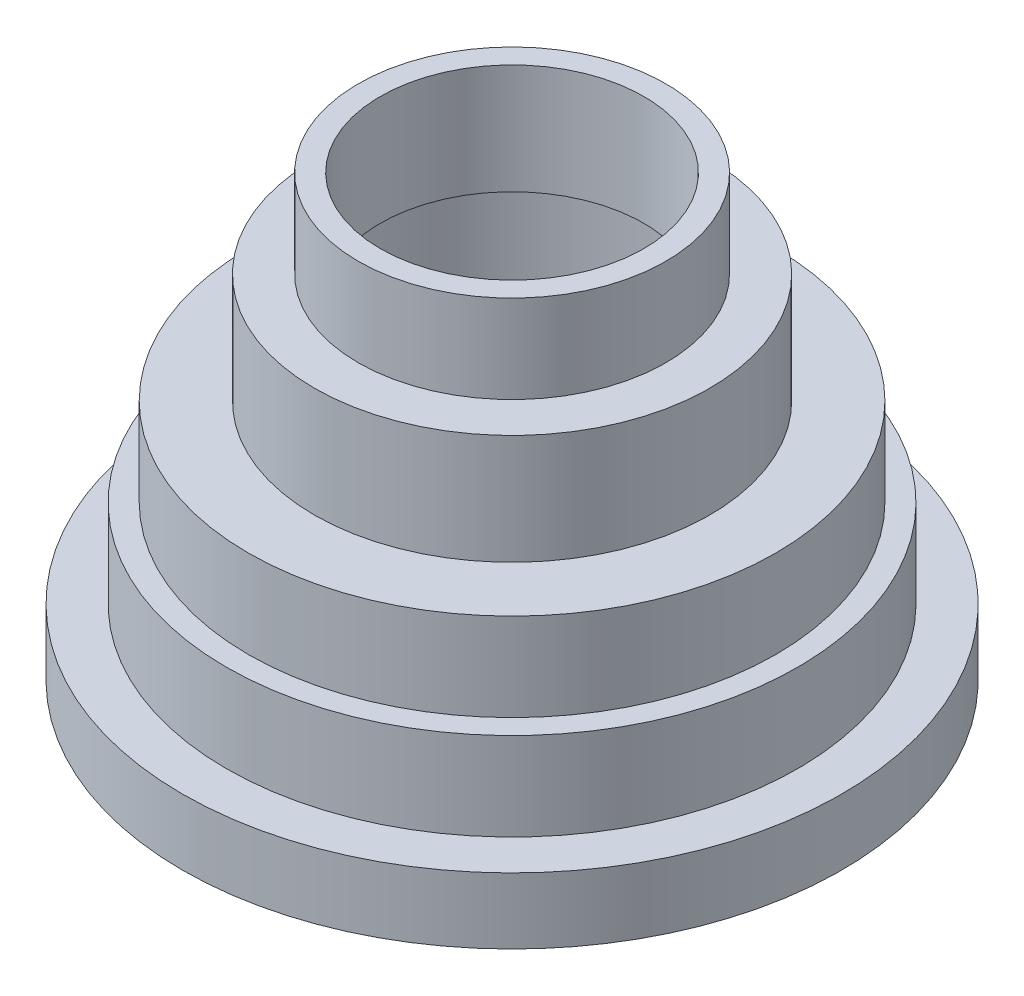
ISO-10303-21;
HEADER;
FILE_DESCRIPTION(('STEP AP214'),'2;1');
FILE_NAME('part.step','',(''),(''),'','','');
FILE_SCHEMA(('AUTOMOTIVE_DESIGN { 1 0 10303 214 1 1 1 1 }'));
ENDSEC;
DATA;
#1=APPLICATION_CONTEXT('core data for automotive mechanical design processes');
#2=APPLICATION_PROTOCOL_DEFINITION('international standard','automotive_design',2000,#1);
#3=PRODUCT_CONTEXT('',#1,'mechanical');
#4=PRODUCT('Part','Part','',(#3));
#5=PRODUCT_RELATED_PRODUCT_CATEGORY('part','',(#4));
#6=PRODUCT_DEFINITION_FORMATION('','',#4);
#7=PRODUCT_DEFINITION_CONTEXT('part definition',#1,'design');
#8=PRODUCT_DEFINITION('design','',#6,#7);
#9=PRODUCT_DEFINITION_SHAPE('','',#8);
#10=(LENGTH_UNIT() NAMED_UNIT(*) SI_UNIT(.MILLI.,.METRE.));
#11=(NAMED_UNIT(*) PLANE_ANGLE_UNIT() SI_UNIT($,.RADIAN.));
#12=(NAMED_UNIT(*) SI_UNIT($,.STERADIAN.) SOLID_ANGLE_UNIT());
#13=UNCERTAINTY_MEASURE_WITH_UNIT(LENGTH_MEASURE(1.E-05),#10,'distance_accuracy_value','');
#14=(GEOMETRIC_REPRESENTATION_CONTEXT(3) GLOBAL_UNCERTAINTY_ASSIGNED_CONTEXT((#13)) GLOBAL_UNIT_ASSIGNED_CONTEXT((#10,
#11,#12)) REPRESENTATION_CONTEXT('',''));
#15=CARTESIAN_POINT('',(0.,0.,0.));
#16=DIRECTION('',(0.,0.,1.));
#17=DIRECTION('',(1.,0.,0.));
#18=AXIS2_PLACEMENT_3D('',#15,#16,#17);
#19=CARTESIAN_POINT('',(-75.,-49.4036697247706,0.));
#20=DIRECTION('',(0.,-1.,0.));
#21=DIRECTION('',(0.,0.,-1.));
#22=AXIS2_PLACEMENT_3D('',#19,#20,#21);
#23=PLANE('',#22);
#24=CARTESIAN_POINT('',(0.,-49.4036697247706,0.));
#25=DIRECTION('',(0.,1.,0.));
#26=DIRECTION('',(0.,0.,1.));
#27=AXIS2_PLACEMENT_3D('',#24,#25,#26);
#28=CIRCLE('',#27,70.);
#29=CARTESIAN_POINT('',(0.,-49.4036697247706,70.));
#30=VERTEX_POINT('',#29);
#31=EDGE_CURVE('E10',#30,#30,#28,.T.);
#32=ORIENTED_EDGE('',*,*,#31,.T.);
#33=EDGE_LOOP('',(#32));
#34=FACE_BOUND('',#33,.T.);
#35=CARTESIAN_POINT('',(0.,-49.4036697247706,0.));
#36=DIRECTION('',(0.,1.,0.));
#37=DIRECTION('',(0.,0.,1.));
#38=AXIS2_PLACEMENT_3D('',#35,#36,#37);
#39=CIRCLE('',#38,75.);
#40=CARTESIAN_POINT('',(0.,-49.4036697247706,75.));
#41=VERTEX_POINT('',#40);
#42=EDGE_CURVE('E101',#41,#41,#39,.T.);
#43=ORIENTED_EDGE('',*,*,#42,.F.);
#44=EDGE_LOOP('',(#43));
#45=FACE_BOUND('',#44,.T.);
#46=ADVANCED_FACE('F37',(#34,#45),#23,.T.);
#47=CARTESIAN_POINT('',(0.,50.,0.));
#48=DIRECTION('',(0.,1.,0.));
#49=DIRECTION('',(0.,0.,1.));
#50=AXIS2_PLACEMENT_3D('',#47,#48,#49);
#51=CYLINDRICAL_SURFACE('',#50,70.);
#52=CARTESIAN_POINT('',(0.,-39.4036697247707,0.));
#53=DIRECTION('',(0.,1.,0.));
#54=DIRECTION('',(0.,0.,1.));
#55=AXIS2_PLACEMENT_3D('',#52,#53,#54);
#56=CIRCLE('',#55,70.);
#57=CARTESIAN_POINT('',(0.,-39.4036697247707,70.));
#58=VERTEX_POINT('',#57);
#59=EDGE_CURVE('E43',#58,#58,#56,.T.);
#60=ORIENTED_EDGE('',*,*,#59,.T.);
#61=EDGE_LOOP('',(#60));
#62=FACE_BOUND('',#61,.T.);
#63=ORIENTED_EDGE('',*,*,#31,.F.);
#64=EDGE_LOOP('',(#63));
#65=FACE_BOUND('',#64,.T.);
#66=ADVANCED_FACE('F109',(#62,#65),#51,.F.);
#67=CARTESIAN_POINT('',(-70.,-39.4036697247706,0.));
#68=DIRECTION('',(0.,-1.,0.));
#69=DIRECTION('',(0.,0.,-1.));
#70=AXIS2_PLACEMENT_3D('',#67,#68,#69);
#71=PLANE('',#70);
#72=CARTESIAN_POINT('',(0.,-39.4036697247707,0.));
#73=DIRECTION('',(0.,1.,0.));
#74=DIRECTION('',(0.,0.,1.));
#75=AXIS2_PLACEMENT_3D('',#72,#73,#74);
#76=CIRCLE('',#75,60.);
#77=CARTESIAN_POINT('',(0.,-39.4036697247707,60.));
#78=VERTEX_POINT('',#77);
#79=EDGE_CURVE('E47',#78,#78,#76,.T.);
#80=ORIENTED_EDGE('',*,*,#79,.T.);
#81=EDGE_LOOP('',(#80));
#82=FACE_BOUND('',#81,.T.);
#83=ORIENTED_EDGE('',*,*,#59,.F.);
#84=EDGE_LOOP('',(#83));
#85=FACE_BOUND('',#84,.T.);
#86=ADVANCED_FACE('F113',(#82,#85),#71,.T.);
#87=CARTESIAN_POINT('',(0.,50.,0.));
#88=DIRECTION('',(0.,1.,0.));
#89=DIRECTION('',(0.,0.,1.));
#90=AXIS2_PLACEMENT_3D('',#87,#88,#89);
#91=CYLINDRICAL_SURFACE('',#90,60.);
#92=CARTESIAN_POINT('',(0.,-19.4036697247706,0.));
#93=DIRECTION('',(0.,1.,0.));
#94=DIRECTION('',(0.,0.,1.));
#95=AXIS2_PLACEMENT_3D('',#92,#93,#94);
#96=CIRCLE('',#95,60.);
#97=CARTESIAN_POINT('',(0.,-19.4036697247706,60.));
#98=VERTEX_POINT('',#97);
#99=EDGE_CURVE('E51',#98,#98,#96,.T.);
#100=ORIENTED_EDGE('',*,*,#99,.T.);
#101=EDGE_LOOP('',(#100));
#102=FACE_BOUND('',#101,.T.);
#103=ORIENTED_EDGE('',*,*,#79,.F.);
#104=EDGE_LOOP('',(#103));
#105=FACE_BOUND('',#104,.T.);
#106=ADVANCED_FACE('F117',(#102,#105),#91,.F.);
#107=CARTESIAN_POINT('',(-60.,-19.4036697247706,0.));
#108=DIRECTION('',(0.,-1.,0.));
#109=DIRECTION('',(0.,0.,-1.));
#110=AXIS2_PLACEMENT_3D('',#107,#108,#109);
#111=PLANE('',#110);
#112=CARTESIAN_POINT('',(0.,-19.4036697247706,0.));
#113=DIRECTION('',(0.,1.,0.));
#114=DIRECTION('',(0.,0.,1.));
#115=AXIS2_PLACEMENT_3D('',#112,#113,#114);
#116=CIRCLE('',#115,55.);
#117=CARTESIAN_POINT('',(0.,-19.4036697247706,55.));
#118=VERTEX_POINT('',#117);
#119=EDGE_CURVE('E56',#118,#118,#116,.T.);
#120=ORIENTED_EDGE('',*,*,#119,.T.);
#121=EDGE_LOOP('',(#120));
#122=FACE_BOUND('',#121,.T.);
#123=ORIENTED_EDGE('',*,*,#99,.F.);
#124=EDGE_LOOP('',(#123));
#125=FACE_BOUND('',#124,.T.);
#126=ADVANCED_FACE('F124',(#122,#125),#111,.T.);
#127=CARTESIAN_POINT('',(0.,50.,0.));
#128=DIRECTION('',(0.,1.,0.));
#129=DIRECTION('',(0.,0.,1.));
#130=AXIS2_PLACEMENT_3D('',#127,#128,#129);
#131=CYLINDRICAL_SURFACE('',#130,55.);
#132=CARTESIAN_POINT('',(0.,0.596330275229359,0.));
#133=DIRECTION('',(0.,1.,0.));
#134=DIRECTION('',(0.,0.,1.));
#135=AXIS2_PLACEMENT_3D('',#132,#133,#134);
#136=CIRCLE('',#135,55.);
#137=CARTESIAN_POINT('',(0.,0.596330275229359,55.));
#138=VERTEX_POINT('',#137);
#139=EDGE_CURVE('E59',#138,#138,#136,.T.);
#140=ORIENTED_EDGE('',*,*,#139,.T.);
#141=EDGE_LOOP('',(#140));
#142=FACE_BOUND('',#141,.T.);
#143=ORIENTED_EDGE('',*,*,#119,.F.);
#144=EDGE_LOOP('',(#143));
#145=FACE_BOUND('',#144,.T.);
#146=ADVANCED_FACE('F128',(#142,#145),#131,.F.);
#147=CARTESIAN_POINT('',(-55.,0.596330275229357,0.));
#148=DIRECTION('',(0.,-1.,0.));
#149=DIRECTION('',(0.,0.,-1.));
#150=AXIS2_PLACEMENT_3D('',#147,#148,#149);
#151=PLANE('',#150);
#152=CARTESIAN_POINT('',(0.,0.596330275229359,0.));
#153=DIRECTION('',(0.,1.,0.));
#154=DIRECTION('',(0.,0.,1.));
#155=AXIS2_PLACEMENT_3D('',#152,#153,#154);
#156=CIRCLE('',#155,40.);
#157=CARTESIAN_POINT('',(0.,0.596330275229359,40.));
#158=VERTEX_POINT('',#157);
#159=EDGE_CURVE('E62',#158,#158,#156,.T.);
#160=ORIENTED_EDGE('',*,*,#159,.T.);
#161=EDGE_LOOP('',(#160));
#162=FACE_BOUND('',#161,.T.);
#163=ORIENTED_EDGE('',*,*,#139,.F.);
#164=EDGE_LOOP('',(#163));
#165=FACE_BOUND('',#164,.T.);
#166=ADVANCED_FACE('F132',(#162,#165),#151,.T.);
#167=CARTESIAN_POINT('',(0.,50.,0.));
#168=DIRECTION('',(0.,1.,0.));
#169=DIRECTION('',(0.,0.,1.));
#170=AXIS2_PLACEMENT_3D('',#167,#168,#169);
#171=CYLINDRICAL_SURFACE('',#170,40.);
#172=CARTESIAN_POINT('',(0.,25.5963302752294,0.));
#173=DIRECTION('',(0.,1.,0.));
#174=DIRECTION('',(0.,0.,1.));
#175=AXIS2_PLACEMENT_3D('',#172,#173,#174);
#176=CIRCLE('',#175,40.);
#177=CARTESIAN_POINT('',(0.,25.5963302752294,40.));
#178=VERTEX_POINT('',#177);
#179=EDGE_CURVE('E65',#178,#178,#176,.T.);
#180=ORIENTED_EDGE('',*,*,#179,.T.);
#181=EDGE_LOOP('',(#180));
#182=FACE_BOUND('',#181,.T.);
#183=ORIENTED_EDGE('',*,*,#159,.F.);
#184=EDGE_LOOP('',(#183));
#185=FACE_BOUND('',#184,.T.);
#186=ADVANCED_FACE('F136',(#182,#185),#171,.F.);
#187=CARTESIAN_POINT('',(-40.,25.5963302752294,0.));
#188=DIRECTION('',(0.,-1.,0.));
#189=DIRECTION('',(0.,0.,-1.));
#190=AXIS2_PLACEMENT_3D('',#187,#188,#189);
#191=PLANE('',#190);
#192=CARTESIAN_POINT('',(0.,25.5963302752294,0.));
#193=DIRECTION('',(0.,1.,0.));
#194=DIRECTION('',(0.,0.,1.));
#195=AXIS2_PLACEMENT_3D('',#192,#193,#194);
#196=CIRCLE('',#195,30.);
#197=CARTESIAN_POINT('',(0.,25.5963302752294,30.));
#198=VERTEX_POINT('',#197);
#199=EDGE_CURVE('E68',#198,#198,#196,.T.);
#200=ORIENTED_EDGE('',*,*,#199,.T.);
#201=EDGE_LOOP('',(#200));
#202=FACE_BOUND('',#201,.T.);
#203=ORIENTED_EDGE('',*,*,#179,.F.);
#204=EDGE_LOOP('',(#203));
#205=FACE_BOUND('',#204,.T.);
#206=ADVANCED_FACE('F140',(#202,#205),#191,.T.);
#207=CARTESIAN_POINT('',(0.,50.,0.));
#208=DIRECTION('',(0.,1.,0.));
#209=DIRECTION('',(0.,0.,1.));
#210=AXIS2_PLACEMENT_3D('',#207,#208,#209);
#211=CYLINDRICAL_SURFACE('',#210,30.);
#212=CARTESIAN_POINT('',(0.,50.5963302752294,0.));
#213=DIRECTION('',(0.,1.,0.));
#214=DIRECTION('',(0.,0.,1.));
#215=AXIS2_PLACEMENT_3D('',#212,#213,#214);
#216=CIRCLE('',#215,30.);
#217=CARTESIAN_POINT('',(0.,50.5963302752294,30.));
#218=VERTEX_POINT('',#217);
#219=EDGE_CURVE('E71',#218,#218,#216,.T.);
#220=ORIENTED_EDGE('',*,*,#219,.T.);
#221=EDGE_LOOP('',(#220));
#222=FACE_BOUND('',#221,.T.);
#223=ORIENTED_EDGE('',*,*,#199,.F.);
#224=EDGE_LOOP('',(#223));
#225=FACE_BOUND('',#224,.T.);
#226=ADVANCED_FACE('F144',(#222,#225),#211,.F.);
#227=CARTESIAN_POINT('',(-35.,50.5963302752294,0.));
#228=DIRECTION('',(0.,1.,0.));
#229=DIRECTION('',(0.,0.,1.));
#230=AXIS2_PLACEMENT_3D('',#227,#228,#229);
#231=PLANE('',#230);
#232=CARTESIAN_POINT('',(0.,50.5963302752294,0.));
#233=DIRECTION('',(0.,1.,0.));
#234=DIRECTION('',(0.,0.,1.));
#235=AXIS2_PLACEMENT_3D('',#232,#233,#234);
#236=CIRCLE('',#235,35.);
#237=CARTESIAN_POINT('',(0.,50.5963302752294,35.));
#238=VERTEX_POINT('',#237);
#239=EDGE_CURVE('E74',#238,#238,#236,.T.);
#240=ORIENTED_EDGE('',*,*,#239,.T.);
#241=EDGE_LOOP('',(#240));
#242=FACE_BOUND('',#241,.T.);
#243=ORIENTED_EDGE('',*,*,#219,.F.);
#244=EDGE_LOOP('',(#243));
#245=FACE_BOUND('',#244,.T.);
#246=ADVANCED_FACE('F148',(#242,#245),#231,.T.);
#247=CARTESIAN_POINT('',(0.,50.,0.));
#248=DIRECTION('',(0.,1.,0.));
#249=DIRECTION('',(0.,0.,1.));
#250=AXIS2_PLACEMENT_3D('',#247,#248,#249);
#251=CYLINDRICAL_SURFACE('',#250,35.);
#252=CARTESIAN_POINT('',(0.,30.5963302752294,0.));
#253=DIRECTION('',(0.,1.,0.));
#254=DIRECTION('',(0.,0.,1.));
#255=AXIS2_PLACEMENT_3D('',#252,#253,#254);
#256=CIRCLE('',#255,35.);
#257=CARTESIAN_POINT('',(0.,30.5963302752294,35.));
#258=VERTEX_POINT('',#257);
#259=EDGE_CURVE('E77',#258,#258,#256,.T.);
#260=ORIENTED_EDGE('',*,*,#259,.T.);
#261=EDGE_LOOP('',(#260));
#262=FACE_BOUND('',#261,.T.);
#263=ORIENTED_EDGE('',*,*,#239,.F.);
#264=EDGE_LOOP('',(#263));
#265=FACE_BOUND('',#264,.T.);
#266=ADVANCED_FACE('F152',(#262,#265),#251,.T.);
#267=CARTESIAN_POINT('',(-45.,30.5963302752294,0.));
#268=DIRECTION('',(0.,1.,0.));
#269=DIRECTION('',(0.,0.,1.));
#270=AXIS2_PLACEMENT_3D('',#267,#268,#269);
#271=PLANE('',#270);
#272=CARTESIAN_POINT('',(0.,30.5963302752294,0.));
#273=DIRECTION('',(0.,1.,0.));
#274=DIRECTION('',(0.,0.,1.));
#275=AXIS2_PLACEMENT_3D('',#272,#273,#274);
#276=CIRCLE('',#275,45.);
#277=CARTESIAN_POINT('',(0.,30.5963302752294,45.));
#278=VERTEX_POINT('',#277);
#279=EDGE_CURVE('E80',#278,#278,#276,.T.);
#280=ORIENTED_EDGE('',*,*,#279,.T.);
#281=EDGE_LOOP('',(#280));
#282=FACE_BOUND('',#281,.T.);
#283=ORIENTED_EDGE('',*,*,#259,.F.);
#284=EDGE_LOOP('',(#283));
#285=FACE_BOUND('',#284,.T.);
#286=ADVANCED_FACE('F156',(#282,#285),#271,.T.);
#287=CARTESIAN_POINT('',(0.,50.,0.));
#288=DIRECTION('',(0.,1.,0.));
#289=DIRECTION('',(0.,0.,1.));
#290=AXIS2_PLACEMENT_3D('',#287,#288,#289);
#291=CYLINDRICAL_SURFACE('',#290,45.);
#292=CARTESIAN_POINT('',(0.,5.59633027522936,0.));
#293=DIRECTION('',(0.,1.,0.));
#294=DIRECTION('',(0.,0.,1.));
#295=AXIS2_PLACEMENT_3D('',#292,#293,#294);
#296=CIRCLE('',#295,45.);
#297=CARTESIAN_POINT('',(0.,5.59633027522936,45.));
#298=VERTEX_POINT('',#297);
#299=EDGE_CURVE('E83',#298,#298,#296,.T.);
#300=ORIENTED_EDGE('',*,*,#299,.T.);
#301=EDGE_LOOP('',(#300));
#302=FACE_BOUND('',#301,.T.);
#303=ORIENTED_EDGE('',*,*,#279,.F.);
#304=EDGE_LOOP('',(#303));
#305=FACE_BOUND('',#304,.T.);
#306=ADVANCED_FACE('F160',(#302,#305),#291,.T.);
#307=CARTESIAN_POINT('',(-60.,5.59633027522936,0.));
#308=DIRECTION('',(0.,1.,0.));
#309=DIRECTION('',(0.,0.,1.));
#310=AXIS2_PLACEMENT_3D('',#307,#308,#309);
#311=PLANE('',#310);
#312=CARTESIAN_POINT('',(0.,5.59633027522936,0.));
#313=DIRECTION('',(0.,1.,0.));
#314=DIRECTION('',(0.,0.,1.));
#315=AXIS2_PLACEMENT_3D('',#312,#313,#314);
#316=CIRCLE('',#315,60.);
#317=CARTESIAN_POINT('',(0.,5.59633027522936,60.));
#318=VERTEX_POINT('',#317);
#319=EDGE_CURVE('E86',#318,#318,#316,.T.);
#320=ORIENTED_EDGE('',*,*,#319,.T.);
#321=EDGE_LOOP('',(#320));
#322=FACE_BOUND('',#321,.T.);
#323=ORIENTED_EDGE('',*,*,#299,.F.);
#324=EDGE_LOOP('',(#323));
#325=FACE_BOUND('',#324,.T.);
#326=ADVANCED_FACE('F164',(#322,#325),#311,.T.);
#327=CARTESIAN_POINT('',(0.,50.,0.));
#328=DIRECTION('',(0.,1.,0.));
#329=DIRECTION('',(0.,0.,1.));
#330=AXIS2_PLACEMENT_3D('',#327,#328,#329);
#331=CYLINDRICAL_SURFACE('',#330,60.);
#332=CARTESIAN_POINT('',(0.,-14.4036697247706,0.));
#333=DIRECTION('',(0.,1.,0.));
#334=DIRECTION('',(0.,0.,1.));
#335=AXIS2_PLACEMENT_3D('',#332,#333,#334);
#336=CIRCLE('',#335,60.);
#337=CARTESIAN_POINT('',(0.,-14.4036697247706,60.));
#338=VERTEX_POINT('',#337);
#339=EDGE_CURVE('E89',#338,#338,#336,.T.);
#340=ORIENTED_EDGE('',*,*,#339,.T.);
#341=EDGE_LOOP('',(#340));
#342=FACE_BOUND('',#341,.T.);
#343=ORIENTED_EDGE('',*,*,#319,.F.);
#344=EDGE_LOOP('',(#343));
#345=FACE_BOUND('',#344,.T.);
#346=ADVANCED_FACE('F168',(#342,#345),#331,.T.);
#347=CARTESIAN_POINT('',(-65.,-14.4036697247706,0.));
#348=DIRECTION('',(0.,1.,0.));
#349=DIRECTION('',(0.,0.,1.));
#350=AXIS2_PLACEMENT_3D('',#347,#348,#349);
#351=PLANE('',#350);
#352=CARTESIAN_POINT('',(0.,-14.4036697247706,0.));
#353=DIRECTION('',(0.,1.,0.));
#354=DIRECTION('',(0.,0.,1.));
#355=AXIS2_PLACEMENT_3D('',#352,#353,#354);
#356=CIRCLE('',#355,65.);
#357=CARTESIAN_POINT('',(0.,-14.4036697247706,65.));
#358=VERTEX_POINT('',#357);
#359=EDGE_CURVE('E92',#358,#358,#356,.T.);
#360=ORIENTED_EDGE('',*,*,#359,.T.);
#361=EDGE_LOOP('',(#360));
#362=FACE_BOUND('',#361,.T.);
#363=ORIENTED_EDGE('',*,*,#339,.F.);
#364=EDGE_LOOP('',(#363));
#365=FACE_BOUND('',#364,.T.);
#366=ADVANCED_FACE('F172',(#362,#365),#351,.T.);
#367=CARTESIAN_POINT('',(0.,50.,0.));
#368=DIRECTION('',(0.,1.,0.));
#369=DIRECTION('',(0.,0.,1.));
#370=AXIS2_PLACEMENT_3D('',#367,#368,#369);
#371=CYLINDRICAL_SURFACE('',#370,65.);
#372=CARTESIAN_POINT('',(0.,-34.4036697247706,0.));
#373=DIRECTION('',(0.,1.,0.));
#374=DIRECTION('',(0.,0.,1.));
#375=AXIS2_PLACEMENT_3D('',#372,#373,#374);
#376=CIRCLE('',#375,65.);
#377=CARTESIAN_POINT('',(0.,-34.4036697247706,65.));
#378=VERTEX_POINT('',#377);
#379=EDGE_CURVE('E95',#378,#378,#376,.T.);
#380=ORIENTED_EDGE('',*,*,#379,.T.);
#381=EDGE_LOOP('',(#380));
#382=FACE_BOUND('',#381,.T.);
#383=ORIENTED_EDGE('',*,*,#359,.F.);
#384=EDGE_LOOP('',(#383));
#385=FACE_BOUND('',#384,.T.);
#386=ADVANCED_FACE('F176',(#382,#385),#371,.T.);
#387=CARTESIAN_POINT('',(-75.,-34.4036697247706,0.));
#388=DIRECTION('',(0.,1.,0.));
#389=DIRECTION('',(0.,0.,1.));
#390=AXIS2_PLACEMENT_3D('',#387,#388,#389);
#391=PLANE('',#390);
#392=CARTESIAN_POINT('',(0.,-34.4036697247706,0.));
#393=DIRECTION('',(0.,1.,0.));
#394=DIRECTION('',(0.,0.,1.));
#395=AXIS2_PLACEMENT_3D('',#392,#393,#394);
#396=CIRCLE('',#395,75.);
#397=CARTESIAN_POINT('',(0.,-34.4036697247706,75.));
#398=VERTEX_POINT('',#397);
#399=EDGE_CURVE('E98',#398,#398,#396,.T.);
#400=ORIENTED_EDGE('',*,*,#399,.T.);
#401=EDGE_LOOP('',(#400));
#402=FACE_BOUND('',#401,.T.);
#403=ORIENTED_EDGE('',*,*,#379,.F.);
#404=EDGE_LOOP('',(#403));
#405=FACE_BOUND('',#404,.T.);
#406=ADVANCED_FACE('F180',(#402,#405),#391,.T.);
#407=CARTESIAN_POINT('',(0.,50.,0.));
#408=DIRECTION('',(0.,1.,0.));
#409=DIRECTION('',(0.,0.,1.));
#410=AXIS2_PLACEMENT_3D('',#407,#408,#409);
#411=CYLINDRICAL_SURFACE('',#410,75.);
#412=ORIENTED_EDGE('',*,*,#42,.T.);
#413=EDGE_LOOP('',(#412));
#414=FACE_BOUND('',#413,.T.);
#415=ORIENTED_EDGE('',*,*,#399,.F.);
#416=EDGE_LOOP('',(#415));
#417=FACE_BOUND('',#416,.T.);
#418=ADVANCED_FACE('F105',(#414,#417),#411,.T.);
#419=CLOSED_SHELL('',(#46,#66,#86,#106,#126,#146,#166,#186,#206,#226,#246,#266,#286,#306,#326,
#346,#366,#386,#406,#418));
#420=MANIFOLD_SOLID_BREP('B2',#419);
#421=ADVANCED_BREP_SHAPE_REPRESENTATION('',(#18,#420),#14);
#422=SHAPE_DEFINITION_REPRESENTATION(#9,#421);
ENDSEC;
END-ISO-10303-21;
